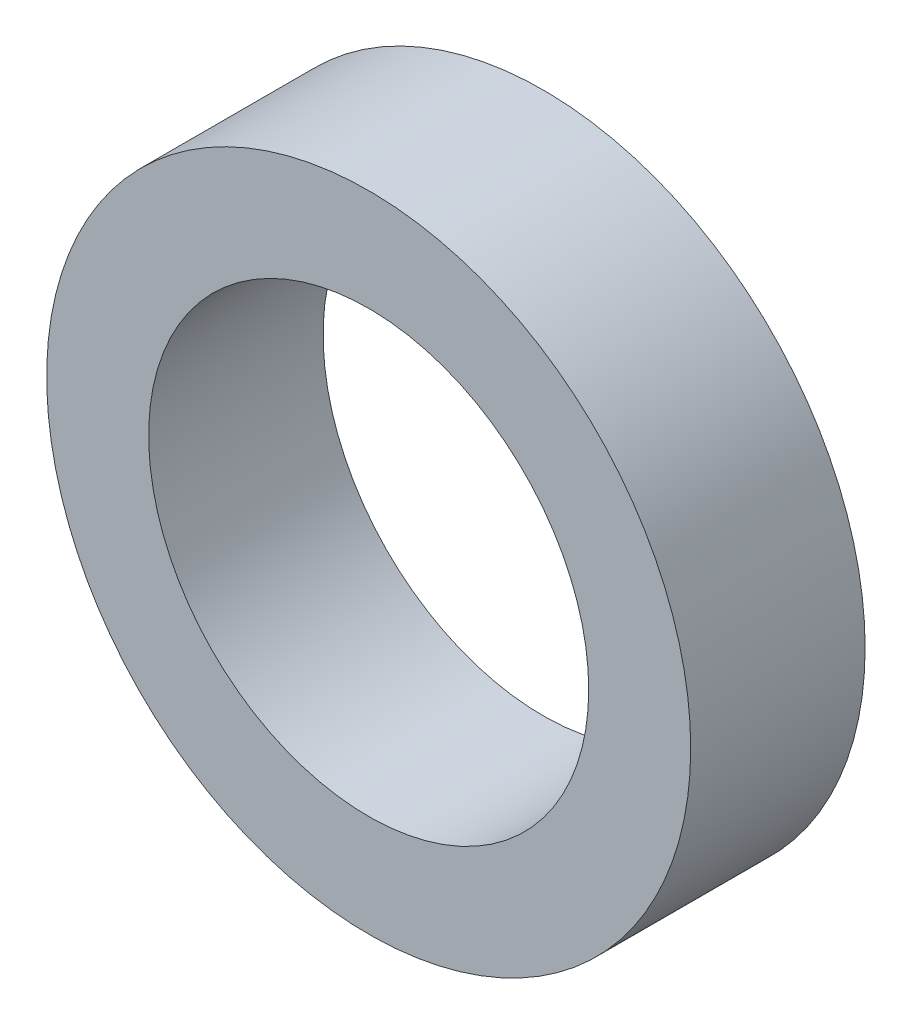
ISO-10303-21;
HEADER;
FILE_DESCRIPTION(('STEP AP214'),'2;1');
FILE_NAME('part.step','',(''),(''),'','','');
FILE_SCHEMA(('AUTOMOTIVE_DESIGN { 1 0 10303 214 1 1 1 1 }'));
ENDSEC;
DATA;
#1=APPLICATION_CONTEXT('core data for automotive mechanical design processes');
#2=APPLICATION_PROTOCOL_DEFINITION('international standard','automotive_design',2000,#1);
#3=PRODUCT_CONTEXT('',#1,'mechanical');
#4=PRODUCT('Part','Part','',(#3));
#5=PRODUCT_RELATED_PRODUCT_CATEGORY('part','',(#4));
#6=PRODUCT_DEFINITION_FORMATION('','',#4);
#7=PRODUCT_DEFINITION_CONTEXT('part definition',#1,'design');
#8=PRODUCT_DEFINITION('design','',#6,#7);
#9=PRODUCT_DEFINITION_SHAPE('','',#8);
#10=(LENGTH_UNIT() NAMED_UNIT(*) SI_UNIT(.MILLI.,.METRE.));
#11=(NAMED_UNIT(*) PLANE_ANGLE_UNIT() SI_UNIT($,.RADIAN.));
#12=(NAMED_UNIT(*) SI_UNIT($,.STERADIAN.) SOLID_ANGLE_UNIT());
#13=UNCERTAINTY_MEASURE_WITH_UNIT(LENGTH_MEASURE(1.E-05),#10,'distance_accuracy_value','');
#14=(GEOMETRIC_REPRESENTATION_CONTEXT(3) GLOBAL_UNCERTAINTY_ASSIGNED_CONTEXT((#13)) GLOBAL_UNIT_ASSIGNED_CONTEXT((#10,
#11,#12)) REPRESENTATION_CONTEXT('',''));
#15=CARTESIAN_POINT('',(0.,0.,0.));
#16=DIRECTION('',(0.,0.,1.));
#17=DIRECTION('',(1.,0.,0.));
#18=AXIS2_PLACEMENT_3D('',#15,#16,#17);
#19=CARTESIAN_POINT('',(0.,0.,1.625));
#20=DIRECTION('',(0.,0.,1.));
#21=DIRECTION('',(1.,0.,0.));
#22=AXIS2_PLACEMENT_3D('',#19,#20,#21);
#23=PLANE('',#22);
#24=CARTESIAN_POINT('',(0.,0.,1.625));
#25=DIRECTION('',(0.,0.,1.));
#26=DIRECTION('',(1.,0.,0.));
#27=AXIS2_PLACEMENT_3D('',#24,#25,#26);
#28=CIRCLE('',#27,6.);
#29=CARTESIAN_POINT('',(6.,0.,1.625));
#30=VERTEX_POINT('',#29);
#31=EDGE_CURVE('E10',#30,#30,#28,.T.);
#32=ORIENTED_EDGE('',*,*,#31,.T.);
#33=EDGE_LOOP('',(#32));
#34=FACE_BOUND('',#33,.T.);
#35=CARTESIAN_POINT('',(0.,0.,1.625));
#36=DIRECTION('',(0.,0.,1.));
#37=DIRECTION('',(1.,0.,0.));
#38=AXIS2_PLACEMENT_3D('',#35,#36,#37);
#39=CIRCLE('',#38,4.1);
#40=CARTESIAN_POINT('',(4.1,0.,1.625));
#41=VERTEX_POINT('',#40);
#42=EDGE_CURVE('E52',#41,#41,#39,.T.);
#43=ORIENTED_EDGE('',*,*,#42,.F.);
#44=EDGE_LOOP('',(#43));
#45=FACE_BOUND('',#44,.T.);
#46=ADVANCED_FACE('F41',(#34,#45),#23,.T.);
#47=CARTESIAN_POINT('',(0.,0.,-1.625));
#48=DIRECTION('',(0.,0.,1.));
#49=DIRECTION('',(1.,0.,0.));
#50=AXIS2_PLACEMENT_3D('',#47,#48,#49);
#51=PLANE('',#50);
#52=CARTESIAN_POINT('',(0.,0.,-1.625));
#53=DIRECTION('',(0.,0.,1.));
#54=DIRECTION('',(1.,0.,0.));
#55=AXIS2_PLACEMENT_3D('',#52,#53,#54);
#56=CIRCLE('',#55,6.);
#57=CARTESIAN_POINT('',(6.,0.,-1.625));
#58=VERTEX_POINT('',#57);
#59=EDGE_CURVE('E45',#58,#58,#56,.T.);
#60=ORIENTED_EDGE('',*,*,#59,.F.);
#61=EDGE_LOOP('',(#60));
#62=FACE_BOUND('',#61,.T.);
#63=CARTESIAN_POINT('',(0.,0.,-1.625));
#64=DIRECTION('',(0.,0.,1.));
#65=DIRECTION('',(1.,0.,0.));
#66=AXIS2_PLACEMENT_3D('',#63,#64,#65);
#67=CIRCLE('',#66,4.1);
#68=CARTESIAN_POINT('',(4.1,0.,-1.625));
#69=VERTEX_POINT('',#68);
#70=EDGE_CURVE('E54',#69,#69,#67,.T.);
#71=ORIENTED_EDGE('',*,*,#70,.T.);
#72=EDGE_LOOP('',(#71));
#73=FACE_BOUND('',#72,.T.);
#74=ADVANCED_FACE('F64',(#62,#73),#51,.F.);
#75=CARTESIAN_POINT('',(0.,0.,1.625));
#76=DIRECTION('',(0.,0.,-1.));
#77=DIRECTION('',(-1.,0.,0.));
#78=AXIS2_PLACEMENT_3D('',#75,#76,#77);
#79=CYLINDRICAL_SURFACE('',#78,6.);
#80=ORIENTED_EDGE('',*,*,#31,.F.);
#81=EDGE_LOOP('',(#80));
#82=FACE_BOUND('',#81,.T.);
#83=ORIENTED_EDGE('',*,*,#59,.T.);
#84=EDGE_LOOP('',(#83));
#85=FACE_BOUND('',#84,.T.);
#86=ADVANCED_FACE('F43',(#82,#85),#79,.T.);
#87=CARTESIAN_POINT('',(0.,0.,1.625));
#88=DIRECTION('',(0.,0.,-1.));
#89=DIRECTION('',(-1.,0.,0.));
#90=AXIS2_PLACEMENT_3D('',#87,#88,#89);
#91=CYLINDRICAL_SURFACE('',#90,4.1);
#92=ORIENTED_EDGE('',*,*,#42,.T.);
#93=EDGE_LOOP('',(#92));
#94=FACE_BOUND('',#93,.T.);
#95=ORIENTED_EDGE('',*,*,#70,.F.);
#96=EDGE_LOOP('',(#95));
#97=FACE_BOUND('',#96,.T.);
#98=ADVANCED_FACE('F60',(#94,#97),#91,.F.);
#99=CLOSED_SHELL('',(#46,#74,#86,#98));
#100=MANIFOLD_SOLID_BREP('B2',#99);
#101=ADVANCED_BREP_SHAPE_REPRESENTATION('',(#18,#100),#14);
#102=SHAPE_DEFINITION_REPRESENTATION(#9,#101);
ENDSEC;
END-ISO-10303-21;
